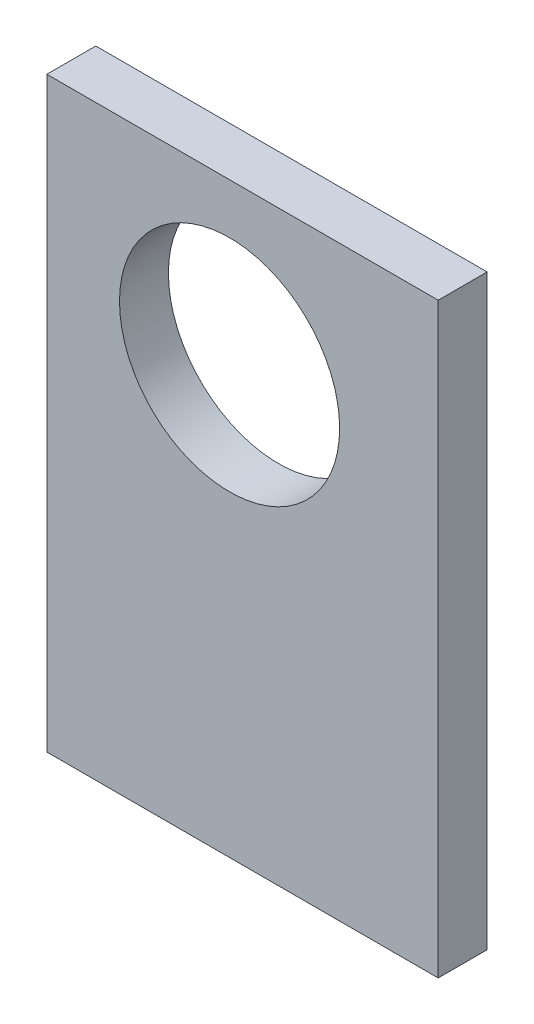
ISO-10303-21;
HEADER;
FILE_DESCRIPTION(('STEP AP214'),'2;1');
FILE_NAME('part.step','',(''),(''),'','','');
FILE_SCHEMA(('AUTOMOTIVE_DESIGN { 1 0 10303 214 1 1 1 1 }'));
ENDSEC;
DATA;
#1=APPLICATION_CONTEXT('core data for automotive mechanical design processes');
#2=APPLICATION_PROTOCOL_DEFINITION('international standard','automotive_design',2000,#1);
#3=PRODUCT_CONTEXT('',#1,'mechanical');
#4=PRODUCT('Part','Part','',(#3));
#5=PRODUCT_RELATED_PRODUCT_CATEGORY('part','',(#4));
#6=PRODUCT_DEFINITION_FORMATION('','',#4);
#7=PRODUCT_DEFINITION_CONTEXT('part definition',#1,'design');
#8=PRODUCT_DEFINITION('design','',#6,#7);
#9=PRODUCT_DEFINITION_SHAPE('','',#8);
#10=(LENGTH_UNIT() NAMED_UNIT(*) SI_UNIT(.MILLI.,.METRE.));
#11=(NAMED_UNIT(*) PLANE_ANGLE_UNIT() SI_UNIT($,.RADIAN.));
#12=(NAMED_UNIT(*) SI_UNIT($,.STERADIAN.) SOLID_ANGLE_UNIT());
#13=UNCERTAINTY_MEASURE_WITH_UNIT(LENGTH_MEASURE(1.E-05),#10,'distance_accuracy_value','');
#14=(GEOMETRIC_REPRESENTATION_CONTEXT(3) GLOBAL_UNCERTAINTY_ASSIGNED_CONTEXT((#13)) GLOBAL_UNIT_ASSIGNED_CONTEXT((#10,
#11,#12)) REPRESENTATION_CONTEXT('',''));
#15=CARTESIAN_POINT('',(0.,0.,0.));
#16=DIRECTION('',(0.,0.,1.));
#17=DIRECTION('',(1.,0.,0.));
#18=AXIS2_PLACEMENT_3D('',#15,#16,#17);
#19=CARTESIAN_POINT('',(-51.1375415282392,48.6059800664452,6.35));
#20=DIRECTION('',(1.,0.,0.));
#21=DIRECTION('',(0.,0.,-1.));
#22=AXIS2_PLACEMENT_3D('',#19,#20,#21);
#23=PLANE('',#22);
#24=DIRECTION('',(0.,-1.,0.));
#25=VECTOR('',#24,1.);
#26=CARTESIAN_POINT('',(-51.1375415282392,48.6059800664452,0.));
#27=LINE('',#26,#25);
#28=CARTESIAN_POINT('',(-51.1375415282392,48.6059800664452,0.));
#29=VERTEX_POINT('',#28);
#30=CARTESIAN_POINT('',(-51.1375415282392,-27.5940199335548,0.));
#31=VERTEX_POINT('',#30);
#32=EDGE_CURVE('E106',#29,#31,#27,.T.);
#33=ORIENTED_EDGE('',*,*,#32,.T.);
#34=DIRECTION('',(0.,0.,-1.));
#35=VECTOR('',#34,1.);
#36=CARTESIAN_POINT('',(-51.1375415282392,-27.5940199335548,6.35));
#37=LINE('',#36,#35);
#38=CARTESIAN_POINT('',(-51.1375415282392,-27.5940199335548,6.35));
#39=VERTEX_POINT('',#38);
#40=EDGE_CURVE('E11',#39,#31,#37,.T.);
#41=ORIENTED_EDGE('',*,*,#40,.F.);
#42=DIRECTION('',(0.,-1.,0.));
#43=VECTOR('',#42,1.);
#44=CARTESIAN_POINT('',(-51.1375415282392,48.6059800664452,6.35));
#45=LINE('',#44,#43);
#46=CARTESIAN_POINT('',(-51.1375415282392,48.6059800664452,6.35));
#47=VERTEX_POINT('',#46);
#48=EDGE_CURVE('E90',#47,#39,#45,.T.);
#49=ORIENTED_EDGE('',*,*,#48,.F.);
#50=DIRECTION('',(0.,0.,-1.));
#51=VECTOR('',#50,1.);
#52=CARTESIAN_POINT('',(-51.1375415282392,48.6059800664452,6.35));
#53=LINE('',#52,#51);
#54=EDGE_CURVE('E102',#47,#29,#53,.T.);
#55=ORIENTED_EDGE('',*,*,#54,.T.);
#56=EDGE_LOOP('',(#33,#41,#49,#55));
#57=FACE_BOUND('',#56,.T.);
#58=ADVANCED_FACE('F38',(#57),#23,.F.);
#59=CARTESIAN_POINT('',(-51.1375415282392,-27.5940199335548,6.35));
#60=DIRECTION('',(0.,1.,0.));
#61=DIRECTION('',(-1.,0.,0.));
#62=AXIS2_PLACEMENT_3D('',#59,#60,#61);
#63=PLANE('',#62);
#64=DIRECTION('',(1.,0.,0.));
#65=VECTOR('',#64,1.);
#66=CARTESIAN_POINT('',(-51.1375415282392,-27.5940199335548,0.));
#67=LINE('',#66,#65);
#68=CARTESIAN_POINT('',(-0.337541528239227,-27.5940199335548,0.));
#69=VERTEX_POINT('',#68);
#70=EDGE_CURVE('E95',#31,#69,#67,.T.);
#71=ORIENTED_EDGE('',*,*,#70,.T.);
#72=DIRECTION('',(0.,0.,-1.));
#73=VECTOR('',#72,1.);
#74=CARTESIAN_POINT('',(-0.337541528239227,-27.5940199335548,6.35));
#75=LINE('',#74,#73);
#76=CARTESIAN_POINT('',(-0.337541528239227,-27.5940199335548,6.35));
#77=VERTEX_POINT('',#76);
#78=EDGE_CURVE('E47',#77,#69,#75,.T.);
#79=ORIENTED_EDGE('',*,*,#78,.F.);
#80=DIRECTION('',(1.,0.,0.));
#81=VECTOR('',#80,1.);
#82=CARTESIAN_POINT('',(-51.1375415282392,-27.5940199335548,6.35));
#83=LINE('',#82,#81);
#84=EDGE_CURVE('E85',#39,#77,#83,.T.);
#85=ORIENTED_EDGE('',*,*,#84,.F.);
#86=ORIENTED_EDGE('',*,*,#40,.T.);
#87=EDGE_LOOP('',(#71,#79,#85,#86));
#88=FACE_BOUND('',#87,.T.);
#89=ADVANCED_FACE('F94',(#88),#63,.F.);
#90=CARTESIAN_POINT('',(-0.337541528239234,48.6059800664452,6.35));
#91=DIRECTION('',(-1.,0.,0.));
#92=DIRECTION('',(0.,-1.,0.));
#93=AXIS2_PLACEMENT_3D('',#90,#91,#92);
#94=PLANE('',#93);
#95=DIRECTION('',(0.,1.,0.));
#96=VECTOR('',#95,1.);
#97=CARTESIAN_POINT('',(-0.337541528239234,48.6059800664452,0.));
#98=LINE('',#97,#96);
#99=CARTESIAN_POINT('',(-0.337541528239234,48.6059800664452,0.));
#100=VERTEX_POINT('',#99);
#101=EDGE_CURVE('E72',#69,#100,#98,.T.);
#102=ORIENTED_EDGE('',*,*,#101,.T.);
#103=DIRECTION('',(0.,0.,-1.));
#104=VECTOR('',#103,1.);
#105=CARTESIAN_POINT('',(-0.337541528239234,48.6059800664452,6.35));
#106=LINE('',#105,#104);
#107=CARTESIAN_POINT('',(-0.337541528239234,48.6059800664452,6.35));
#108=VERTEX_POINT('',#107);
#109=EDGE_CURVE('E97',#108,#100,#106,.T.);
#110=ORIENTED_EDGE('',*,*,#109,.F.);
#111=DIRECTION('',(0.,1.,0.));
#112=VECTOR('',#111,1.);
#113=CARTESIAN_POINT('',(-0.337541528239234,48.6059800664452,6.35));
#114=LINE('',#113,#112);
#115=EDGE_CURVE('E88',#77,#108,#114,.T.);
#116=ORIENTED_EDGE('',*,*,#115,.F.);
#117=ORIENTED_EDGE('',*,*,#78,.T.);
#118=EDGE_LOOP('',(#102,#110,#116,#117));
#119=FACE_BOUND('',#118,.T.);
#120=ADVANCED_FACE('F98',(#119),#94,.F.);
#121=CARTESIAN_POINT('',(-51.1375415282392,48.6059800664452,6.35));
#122=DIRECTION('',(0.,-1.,0.));
#123=DIRECTION('',(0.,0.,-1.));
#124=AXIS2_PLACEMENT_3D('',#121,#122,#123);
#125=PLANE('',#124);
#126=DIRECTION('',(-1.,0.,0.));
#127=VECTOR('',#126,1.);
#128=CARTESIAN_POINT('',(-51.1375415282392,48.6059800664452,0.));
#129=LINE('',#128,#127);
#130=EDGE_CURVE('E78',#100,#29,#129,.T.);
#131=ORIENTED_EDGE('',*,*,#130,.T.);
#132=ORIENTED_EDGE('',*,*,#54,.F.);
#133=DIRECTION('',(-1.,0.,0.));
#134=VECTOR('',#133,1.);
#135=CARTESIAN_POINT('',(-51.1375415282392,48.6059800664452,6.35));
#136=LINE('',#135,#134);
#137=EDGE_CURVE('E55',#108,#47,#136,.T.);
#138=ORIENTED_EDGE('',*,*,#137,.F.);
#139=ORIENTED_EDGE('',*,*,#109,.T.);
#140=EDGE_LOOP('',(#131,#132,#138,#139));
#141=FACE_BOUND('',#140,.T.);
#142=ADVANCED_FACE('F120',(#141),#125,.F.);
#143=CARTESIAN_POINT('',(0.,0.,6.35));
#144=DIRECTION('',(0.,0.,1.));
#145=DIRECTION('',(1.,0.,0.));
#146=AXIS2_PLACEMENT_3D('',#143,#144,#145);
#147=PLANE('',#146);
#148=CARTESIAN_POINT('',(-27.4217865293878,27.8026004540024,6.35));
#149=DIRECTION('',(0.,0.,1.));
#150=DIRECTION('',(1.,0.,0.));
#151=AXIS2_PLACEMENT_3D('',#148,#149,#150);
#152=CIRCLE('',#151,14.2875);
#153=CARTESIAN_POINT('',(-13.1342865293878,27.8026004540024,6.35));
#154=VERTEX_POINT('',#153);
#155=EDGE_CURVE('E127',#154,#154,#152,.T.);
#156=ORIENTED_EDGE('',*,*,#155,.F.);
#157=EDGE_LOOP('',(#156));
#158=FACE_BOUND('',#157,.T.);
#159=ORIENTED_EDGE('',*,*,#48,.T.);
#160=ORIENTED_EDGE('',*,*,#84,.T.);
#161=ORIENTED_EDGE('',*,*,#115,.T.);
#162=ORIENTED_EDGE('',*,*,#137,.T.);
#163=EDGE_LOOP('',(#159,#160,#161,#162));
#164=FACE_BOUND('',#163,.T.);
#165=ADVANCED_FACE('F86',(#158,#164),#147,.T.);
#166=CARTESIAN_POINT('',(0.,0.,0.));
#167=DIRECTION('',(0.,0.,1.));
#168=DIRECTION('',(1.,0.,0.));
#169=AXIS2_PLACEMENT_3D('',#166,#167,#168);
#170=PLANE('',#169);
#171=CARTESIAN_POINT('',(-27.4217865293878,27.8026004540024,0.));
#172=DIRECTION('',(0.,0.,1.));
#173=DIRECTION('',(1.,0.,0.));
#174=AXIS2_PLACEMENT_3D('',#171,#172,#173);
#175=CIRCLE('',#174,14.2875);
#176=CARTESIAN_POINT('',(-13.1342865293878,27.8026004540024,0.));
#177=VERTEX_POINT('',#176);
#178=EDGE_CURVE('E110',#177,#177,#175,.T.);
#179=ORIENTED_EDGE('',*,*,#178,.T.);
#180=EDGE_LOOP('',(#179));
#181=FACE_BOUND('',#180,.T.);
#182=ORIENTED_EDGE('',*,*,#32,.F.);
#183=ORIENTED_EDGE('',*,*,#130,.F.);
#184=ORIENTED_EDGE('',*,*,#101,.F.);
#185=ORIENTED_EDGE('',*,*,#70,.F.);
#186=EDGE_LOOP('',(#182,#183,#184,#185));
#187=FACE_BOUND('',#186,.T.);
#188=ADVANCED_FACE('F123',(#181,#187),#170,.F.);
#189=CARTESIAN_POINT('',(-27.4217865293878,27.8026004540024,0.));
#190=DIRECTION('',(0.,0.,1.));
#191=DIRECTION('',(1.,0.,0.));
#192=AXIS2_PLACEMENT_3D('',#189,#190,#191);
#193=CYLINDRICAL_SURFACE('',#192,14.2875);
#194=ORIENTED_EDGE('',*,*,#178,.F.);
#195=EDGE_LOOP('',(#194));
#196=FACE_BOUND('',#195,.T.);
#197=ORIENTED_EDGE('',*,*,#155,.T.);
#198=EDGE_LOOP('',(#197));
#199=FACE_BOUND('',#198,.T.);
#200=ADVANCED_FACE('F136',(#196,#199),#193,.F.);
#201=CLOSED_SHELL('',(#58,#89,#120,#142,#165,#188,#200));
#202=MANIFOLD_SOLID_BREP('B2',#201);
#203=ADVANCED_BREP_SHAPE_REPRESENTATION('',(#18,#202),#14);
#204=SHAPE_DEFINITION_REPRESENTATION(#9,#203);
ENDSEC;
END-ISO-10303-21;
